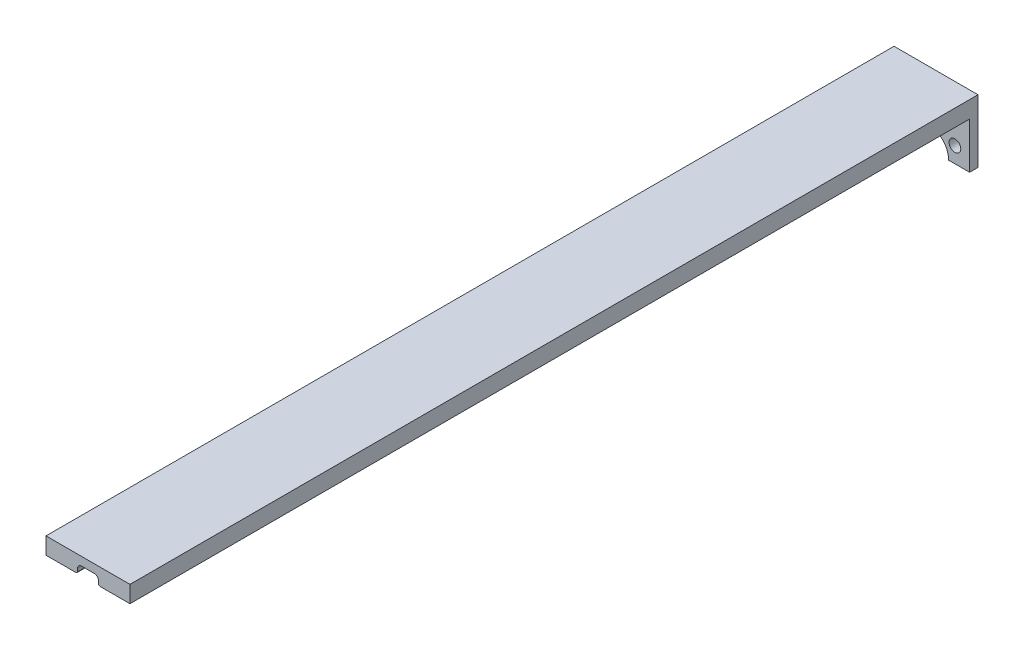
ISO-10303-21;
HEADER;
FILE_DESCRIPTION(('STEP AP214'),'2;1');
FILE_NAME('part.step','',(''),(''),'','','');
FILE_SCHEMA(('AUTOMOTIVE_DESIGN { 1 0 10303 214 1 1 1 1 }'));
ENDSEC;
DATA;
#1=APPLICATION_CONTEXT('core data for automotive mechanical design processes');
#2=APPLICATION_PROTOCOL_DEFINITION('international standard','automotive_design',2000,#1);
#3=PRODUCT_CONTEXT('',#1,'mechanical');
#4=PRODUCT('Part','Part','',(#3));
#5=PRODUCT_RELATED_PRODUCT_CATEGORY('part','',(#4));
#6=PRODUCT_DEFINITION_FORMATION('','',#4);
#7=PRODUCT_DEFINITION_CONTEXT('part definition',#1,'design');
#8=PRODUCT_DEFINITION('design','',#6,#7);
#9=PRODUCT_DEFINITION_SHAPE('','',#8);
#10=(LENGTH_UNIT() NAMED_UNIT(*) SI_UNIT(.MILLI.,.METRE.));
#11=(NAMED_UNIT(*) PLANE_ANGLE_UNIT() SI_UNIT($,.RADIAN.));
#12=(NAMED_UNIT(*) SI_UNIT($,.STERADIAN.) SOLID_ANGLE_UNIT());
#13=UNCERTAINTY_MEASURE_WITH_UNIT(LENGTH_MEASURE(1.E-05),#10,'distance_accuracy_value','');
#14=(GEOMETRIC_REPRESENTATION_CONTEXT(3) GLOBAL_UNCERTAINTY_ASSIGNED_CONTEXT((#13)) GLOBAL_UNIT_ASSIGNED_CONTEXT((#10,
#11,#12)) REPRESENTATION_CONTEXT('',''));
#15=CARTESIAN_POINT('',(0.,0.,0.));
#16=DIRECTION('',(0.,0.,1.));
#17=DIRECTION('',(1.,0.,0.));
#18=AXIS2_PLACEMENT_3D('',#15,#16,#17);
#19=CARTESIAN_POINT('',(0.,0.,2.54));
#20=DIRECTION('',(0.,0.,-1.));
#21=DIRECTION('',(-1.,0.,0.));
#22=AXIS2_PLACEMENT_3D('',#19,#20,#21);
#23=PLANE('',#22);
#24=CARTESIAN_POINT('',(8.24889197104678,4.7625,2.54));
#25=DIRECTION('',(0.,0.,1.));
#26=DIRECTION('',(1.,0.,0.));
#27=AXIS2_PLACEMENT_3D('',#24,#25,#26);
#28=CIRCLE('',#27,1.778);
#29=CARTESIAN_POINT('',(10.0268919710468,4.7625,2.54));
#30=VERTEX_POINT('',#29);
#31=EDGE_CURVE('E287',#30,#30,#28,.T.);
#32=ORIENTED_EDGE('',*,*,#31,.F.);
#33=EDGE_LOOP('',(#32));
#34=FACE_BOUND('',#33,.T.);
#35=CARTESIAN_POINT('',(-8.24889197104678,4.7625,2.54));
#36=DIRECTION('',(0.,0.,1.));
#37=DIRECTION('',(1.,0.,0.));
#38=AXIS2_PLACEMENT_3D('',#35,#36,#37);
#39=CIRCLE('',#38,1.778);
#40=CARTESIAN_POINT('',(-6.47089197104678,4.7625,2.54));
#41=VERTEX_POINT('',#40);
#42=EDGE_CURVE('E295',#41,#41,#39,.T.);
#43=ORIENTED_EDGE('',*,*,#42,.F.);
#44=EDGE_LOOP('',(#43));
#45=FACE_BOUND('',#44,.T.);
#46=DIRECTION('',(1.,0.,0.));
#47=VECTOR('',#46,1.);
#48=CARTESIAN_POINT('',(12.7,13.97,2.54));
#49=LINE('',#48,#47);
#50=CARTESIAN_POINT('',(3.683,13.97,2.54));
#51=VERTEX_POINT('',#50);
#52=CARTESIAN_POINT('',(12.7,13.97,2.54));
#53=VERTEX_POINT('',#52);
#54=EDGE_CURVE('E61',#51,#53,#49,.T.);
#55=ORIENTED_EDGE('',*,*,#54,.F.);
#56=CARTESIAN_POINT('',(3.683,14.478,2.54));
#57=DIRECTION('',(0.,0.,1.));
#58=DIRECTION('',(1.,0.,0.));
#59=AXIS2_PLACEMENT_3D('',#56,#57,#58);
#60=CIRCLE('',#59,0.507999999999998);
#61=CARTESIAN_POINT('',(3.175,14.478,2.54));
#62=VERTEX_POINT('',#61);
#63=EDGE_CURVE('E65',#62,#51,#60,.T.);
#64=ORIENTED_EDGE('',*,*,#63,.F.);
#65=DIRECTION('',(0.,-1.,0.));
#66=VECTOR('',#65,1.);
#67=CARTESIAN_POINT('',(3.175,14.478,2.54));
#68=LINE('',#67,#66);
#69=CARTESIAN_POINT('',(3.175,15.24,2.54));
#70=VERTEX_POINT('',#69);
#71=EDGE_CURVE('E244',#70,#62,#68,.T.);
#72=ORIENTED_EDGE('',*,*,#71,.F.);
#73=CARTESIAN_POINT('',(1.905,15.24,2.54));
#74=DIRECTION('',(0.,0.,-1.));
#75=DIRECTION('',(1.,0.,0.));
#76=AXIS2_PLACEMENT_3D('',#73,#74,#75);
#77=CIRCLE('',#76,1.27);
#78=CARTESIAN_POINT('',(1.905,16.51,2.54));
#79=VERTEX_POINT('',#78);
#80=EDGE_CURVE('E240',#79,#70,#77,.T.);
#81=ORIENTED_EDGE('',*,*,#80,.F.);
#82=DIRECTION('',(1.,0.,0.));
#83=VECTOR('',#82,1.);
#84=CARTESIAN_POINT('',(-1.905,16.51,2.54));
#85=LINE('',#84,#83);
#86=CARTESIAN_POINT('',(-1.905,16.51,2.54));
#87=VERTEX_POINT('',#86);
#88=EDGE_CURVE('E236',#87,#79,#85,.T.);
#89=ORIENTED_EDGE('',*,*,#88,.F.);
#90=CARTESIAN_POINT('',(-1.905,15.24,2.54));
#91=DIRECTION('',(0.,0.,-1.));
#92=DIRECTION('',(-1.,0.,0.));
#93=AXIS2_PLACEMENT_3D('',#90,#91,#92);
#94=CIRCLE('',#93,1.27);
#95=CARTESIAN_POINT('',(-3.175,15.24,2.54));
#96=VERTEX_POINT('',#95);
#97=EDGE_CURVE('E232',#96,#87,#94,.T.);
#98=ORIENTED_EDGE('',*,*,#97,.F.);
#99=DIRECTION('',(0.,1.,0.));
#100=VECTOR('',#99,1.);
#101=CARTESIAN_POINT('',(-3.175,14.478,2.54));
#102=LINE('',#101,#100);
#103=CARTESIAN_POINT('',(-3.175,14.478,2.54));
#104=VERTEX_POINT('',#103);
#105=EDGE_CURVE('E228',#104,#96,#102,.T.);
#106=ORIENTED_EDGE('',*,*,#105,.F.);
#107=CARTESIAN_POINT('',(-3.683,14.478,2.54));
#108=DIRECTION('',(0.,0.,1.));
#109=DIRECTION('',(1.,0.,0.));
#110=AXIS2_PLACEMENT_3D('',#107,#108,#109);
#111=CIRCLE('',#110,0.507999999999998);
#112=CARTESIAN_POINT('',(-3.683,13.97,2.54));
#113=VERTEX_POINT('',#112);
#114=EDGE_CURVE('E224',#113,#104,#111,.T.);
#115=ORIENTED_EDGE('',*,*,#114,.F.);
#116=DIRECTION('',(1.,0.,0.));
#117=VECTOR('',#116,1.);
#118=CARTESIAN_POINT('',(-12.7,13.97,2.54));
#119=LINE('',#118,#117);
#120=CARTESIAN_POINT('',(-12.7,13.97,2.54));
#121=VERTEX_POINT('',#120);
#122=EDGE_CURVE('E220',#121,#113,#119,.T.);
#123=ORIENTED_EDGE('',*,*,#122,.F.);
#124=DIRECTION('',(0.,-1.,0.));
#125=VECTOR('',#124,1.);
#126=CARTESIAN_POINT('',(-12.7,19.05,2.54));
#127=LINE('',#126,#125);
#128=CARTESIAN_POINT('',(-12.7,0.,2.54));
#129=VERTEX_POINT('',#128);
#130=EDGE_CURVE('E303',#121,#129,#127,.T.);
#131=ORIENTED_EDGE('',*,*,#130,.T.);
#132=DIRECTION('',(1.,0.,0.));
#133=VECTOR('',#132,1.);
#134=CARTESIAN_POINT('',(-12.7,0.,2.54));
#135=LINE('',#134,#133);
#136=CARTESIAN_POINT('',(-6.35,0.,2.54));
#137=VERTEX_POINT('',#136);
#138=EDGE_CURVE('E306',#129,#137,#135,.T.);
#139=ORIENTED_EDGE('',*,*,#138,.T.);
#140=CARTESIAN_POINT('',(0.,0.,2.54));
#141=DIRECTION('',(0.,0.,-1.));
#142=DIRECTION('',(-1.,0.,0.));
#143=AXIS2_PLACEMENT_3D('',#140,#141,#142);
#144=CIRCLE('',#143,6.35);
#145=CARTESIAN_POINT('',(6.35,0.,2.54));
#146=VERTEX_POINT('',#145);
#147=EDGE_CURVE('E309',#137,#146,#144,.T.);
#148=ORIENTED_EDGE('',*,*,#147,.T.);
#149=DIRECTION('',(1.,0.,0.));
#150=VECTOR('',#149,1.);
#151=CARTESIAN_POINT('',(6.35,0.,2.54));
#152=LINE('',#151,#150);
#153=CARTESIAN_POINT('',(12.7,0.,2.54));
#154=VERTEX_POINT('',#153);
#155=EDGE_CURVE('E312',#146,#154,#152,.T.);
#156=ORIENTED_EDGE('',*,*,#155,.T.);
#157=DIRECTION('',(0.,1.,0.));
#158=VECTOR('',#157,1.);
#159=CARTESIAN_POINT('',(12.7,0.,2.54));
#160=LINE('',#159,#158);
#161=EDGE_CURVE('E170',#154,#53,#160,.T.);
#162=ORIENTED_EDGE('',*,*,#161,.T.);
#163=EDGE_LOOP('',(#55,#64,#72,#81,#89,#98,#106,#115,#123,#131,#139,#148,#156,#162));
#164=FACE_BOUND('',#163,.T.);
#165=ADVANCED_FACE('F45',(#34,#45,#164),#23,.F.);
#166=CARTESIAN_POINT('',(0.,0.,0.));
#167=DIRECTION('',(0.,0.,-1.));
#168=DIRECTION('',(-1.,0.,0.));
#169=AXIS2_PLACEMENT_3D('',#166,#167,#168);
#170=PLANE('',#169);
#171=CARTESIAN_POINT('',(-8.24889197104678,4.7625,0.));
#172=DIRECTION('',(0.,0.,1.));
#173=DIRECTION('',(1.,0.,0.));
#174=AXIS2_PLACEMENT_3D('',#171,#172,#173);
#175=CIRCLE('',#174,1.778);
#176=CARTESIAN_POINT('',(-6.47089197104678,4.7625,0.));
#177=VERTEX_POINT('',#176);
#178=EDGE_CURVE('E291',#177,#177,#175,.T.);
#179=ORIENTED_EDGE('',*,*,#178,.T.);
#180=EDGE_LOOP('',(#179));
#181=FACE_BOUND('',#180,.T.);
#182=DIRECTION('',(0.,-1.,0.));
#183=VECTOR('',#182,1.);
#184=CARTESIAN_POINT('',(-12.7,19.05,0.));
#185=LINE('',#184,#183);
#186=CARTESIAN_POINT('',(-12.7,19.05,0.));
#187=VERTEX_POINT('',#186);
#188=CARTESIAN_POINT('',(-12.7,0.,0.));
#189=VERTEX_POINT('',#188);
#190=EDGE_CURVE('E299',#187,#189,#185,.T.);
#191=ORIENTED_EDGE('',*,*,#190,.F.);
#192=DIRECTION('',(-1.,0.,0.));
#193=VECTOR('',#192,1.);
#194=CARTESIAN_POINT('',(-12.7,19.05,0.));
#195=LINE('',#194,#193);
#196=CARTESIAN_POINT('',(12.7,19.05,0.));
#197=VERTEX_POINT('',#196);
#198=EDGE_CURVE('E164',#197,#187,#195,.T.);
#199=ORIENTED_EDGE('',*,*,#198,.F.);
#200=DIRECTION('',(0.,1.,0.));
#201=VECTOR('',#200,1.);
#202=CARTESIAN_POINT('',(12.7,0.,0.));
#203=LINE('',#202,#201);
#204=CARTESIAN_POINT('',(12.7,0.,0.));
#205=VERTEX_POINT('',#204);
#206=EDGE_CURVE('E328',#205,#197,#203,.T.);
#207=ORIENTED_EDGE('',*,*,#206,.F.);
#208=DIRECTION('',(1.,0.,0.));
#209=VECTOR('',#208,1.);
#210=CARTESIAN_POINT('',(6.35,0.,0.));
#211=LINE('',#210,#209);
#212=CARTESIAN_POINT('',(6.35,0.,0.));
#213=VERTEX_POINT('',#212);
#214=EDGE_CURVE('E325',#213,#205,#211,.T.);
#215=ORIENTED_EDGE('',*,*,#214,.F.);
#216=CARTESIAN_POINT('',(0.,0.,0.));
#217=DIRECTION('',(0.,0.,-1.));
#218=DIRECTION('',(-1.,0.,0.));
#219=AXIS2_PLACEMENT_3D('',#216,#217,#218);
#220=CIRCLE('',#219,6.35);
#221=CARTESIAN_POINT('',(-6.35,0.,0.));
#222=VERTEX_POINT('',#221);
#223=EDGE_CURVE('E322',#222,#213,#220,.T.);
#224=ORIENTED_EDGE('',*,*,#223,.F.);
#225=DIRECTION('',(1.,0.,0.));
#226=VECTOR('',#225,1.);
#227=CARTESIAN_POINT('',(-12.7,0.,0.));
#228=LINE('',#227,#226);
#229=EDGE_CURVE('E319',#189,#222,#228,.T.);
#230=ORIENTED_EDGE('',*,*,#229,.F.);
#231=EDGE_LOOP('',(#191,#199,#207,#215,#224,#230));
#232=FACE_BOUND('',#231,.T.);
#233=CARTESIAN_POINT('',(8.24889197104678,4.7625,0.));
#234=DIRECTION('',(0.,0.,1.));
#235=DIRECTION('',(1.,0.,0.));
#236=AXIS2_PLACEMENT_3D('',#233,#234,#235);
#237=CIRCLE('',#236,1.778);
#238=CARTESIAN_POINT('',(10.0268919710468,4.7625,0.));
#239=VERTEX_POINT('',#238);
#240=EDGE_CURVE('E286',#239,#239,#237,.T.);
#241=ORIENTED_EDGE('',*,*,#240,.T.);
#242=EDGE_LOOP('',(#241));
#243=FACE_BOUND('',#242,.T.);
#244=ADVANCED_FACE('F354',(#181,#232,#243),#170,.T.);
#245=CARTESIAN_POINT('',(-12.7,19.05,2.54));
#246=DIRECTION('',(1.,0.,0.));
#247=DIRECTION('',(0.,0.,-1.));
#248=AXIS2_PLACEMENT_3D('',#245,#246,#247);
#249=PLANE('',#248);
#250=ORIENTED_EDGE('',*,*,#190,.T.);
#251=DIRECTION('',(0.,0.,-1.));
#252=VECTOR('',#251,1.);
#253=CARTESIAN_POINT('',(-12.7,0.,2.54));
#254=LINE('',#253,#252);
#255=EDGE_CURVE('E11',#129,#189,#254,.T.);
#256=ORIENTED_EDGE('',*,*,#255,.F.);
#257=ORIENTED_EDGE('',*,*,#130,.F.);
#258=DIRECTION('',(0.,0.,-1.));
#259=VECTOR('',#258,1.);
#260=CARTESIAN_POINT('',(-12.7,13.97,256.54));
#261=LINE('',#260,#259);
#262=CARTESIAN_POINT('',(-12.7,13.97,256.54));
#263=VERTEX_POINT('',#262);
#264=EDGE_CURVE('E176',#263,#121,#261,.T.);
#265=ORIENTED_EDGE('',*,*,#264,.F.);
#266=DIRECTION('',(0.,-1.,0.));
#267=VECTOR('',#266,1.);
#268=CARTESIAN_POINT('',(-12.7,19.05,256.54));
#269=LINE('',#268,#267);
#270=CARTESIAN_POINT('',(-12.7,19.05,256.54));
#271=VERTEX_POINT('',#270);
#272=EDGE_CURVE('E173',#271,#263,#269,.T.);
#273=ORIENTED_EDGE('',*,*,#272,.F.);
#274=DIRECTION('',(0.,0.,-1.));
#275=VECTOR('',#274,1.);
#276=CARTESIAN_POINT('',(-12.7,19.05,2.54));
#277=LINE('',#276,#275);
#278=EDGE_CURVE('E157',#271,#187,#277,.T.);
#279=ORIENTED_EDGE('',*,*,#278,.T.);
#280=EDGE_LOOP('',(#250,#256,#257,#265,#273,#279));
#281=FACE_BOUND('',#280,.T.);
#282=ADVANCED_FACE('F47',(#281),#249,.F.);
#283=CARTESIAN_POINT('',(-12.7,0.,2.54));
#284=DIRECTION('',(0.,1.,0.));
#285=DIRECTION('',(0.,0.,1.));
#286=AXIS2_PLACEMENT_3D('',#283,#284,#285);
#287=PLANE('',#286);
#288=ORIENTED_EDGE('',*,*,#229,.T.);
#289=DIRECTION('',(0.,0.,-1.));
#290=VECTOR('',#289,1.);
#291=CARTESIAN_POINT('',(-6.35,0.,2.54));
#292=LINE('',#291,#290);
#293=EDGE_CURVE('E54',#137,#222,#292,.T.);
#294=ORIENTED_EDGE('',*,*,#293,.F.);
#295=ORIENTED_EDGE('',*,*,#138,.F.);
#296=ORIENTED_EDGE('',*,*,#255,.T.);
#297=EDGE_LOOP('',(#288,#294,#295,#296));
#298=FACE_BOUND('',#297,.T.);
#299=ADVANCED_FACE('F400',(#298),#287,.F.);
#300=CARTESIAN_POINT('',(0.,0.,2.54));
#301=DIRECTION('',(0.,0.,-1.));
#302=DIRECTION('',(-1.,0.,0.));
#303=AXIS2_PLACEMENT_3D('',#300,#301,#302);
#304=CYLINDRICAL_SURFACE('',#303,6.35);
#305=ORIENTED_EDGE('',*,*,#223,.T.);
#306=DIRECTION('',(0.,0.,-1.));
#307=VECTOR('',#306,1.);
#308=CARTESIAN_POINT('',(6.35,0.,2.54));
#309=LINE('',#308,#307);
#310=EDGE_CURVE('E339',#146,#213,#309,.T.);
#311=ORIENTED_EDGE('',*,*,#310,.F.);
#312=ORIENTED_EDGE('',*,*,#147,.F.);
#313=ORIENTED_EDGE('',*,*,#293,.T.);
#314=EDGE_LOOP('',(#305,#311,#312,#313));
#315=FACE_BOUND('',#314,.T.);
#316=ADVANCED_FACE('F348',(#315),#304,.F.);
#317=CARTESIAN_POINT('',(6.35,0.,2.54));
#318=DIRECTION('',(0.,1.,0.));
#319=DIRECTION('',(0.,0.,1.));
#320=AXIS2_PLACEMENT_3D('',#317,#318,#319);
#321=PLANE('',#320);
#322=ORIENTED_EDGE('',*,*,#214,.T.);
#323=DIRECTION('',(0.,0.,-1.));
#324=VECTOR('',#323,1.);
#325=CARTESIAN_POINT('',(12.7,0.,2.54));
#326=LINE('',#325,#324);
#327=EDGE_CURVE('E335',#154,#205,#326,.T.);
#328=ORIENTED_EDGE('',*,*,#327,.F.);
#329=ORIENTED_EDGE('',*,*,#155,.F.);
#330=ORIENTED_EDGE('',*,*,#310,.T.);
#331=EDGE_LOOP('',(#322,#328,#329,#330));
#332=FACE_BOUND('',#331,.T.);
#333=ADVANCED_FACE('F359',(#332),#321,.F.);
#334=CARTESIAN_POINT('',(12.7,0.,2.54));
#335=DIRECTION('',(-1.,0.,0.));
#336=DIRECTION('',(0.,0.,1.));
#337=AXIS2_PLACEMENT_3D('',#334,#335,#336);
#338=PLANE('',#337);
#339=ORIENTED_EDGE('',*,*,#206,.T.);
#340=DIRECTION('',(0.,0.,-1.));
#341=VECTOR('',#340,1.);
#342=CARTESIAN_POINT('',(12.7,19.05,2.54));
#343=LINE('',#342,#341);
#344=CARTESIAN_POINT('',(12.7,19.05,256.54));
#345=VERTEX_POINT('',#344);
#346=EDGE_CURVE('E169',#345,#197,#343,.T.);
#347=ORIENTED_EDGE('',*,*,#346,.F.);
#348=DIRECTION('',(0.,1.,0.));
#349=VECTOR('',#348,1.);
#350=CARTESIAN_POINT('',(12.7,19.05,256.54));
#351=LINE('',#350,#349);
#352=CARTESIAN_POINT('',(12.7,13.97,256.54));
#353=VERTEX_POINT('',#352);
#354=EDGE_CURVE('E185',#353,#345,#351,.T.);
#355=ORIENTED_EDGE('',*,*,#354,.F.);
#356=DIRECTION('',(0.,0.,-1.));
#357=VECTOR('',#356,1.);
#358=CARTESIAN_POINT('',(12.7,13.97,256.54));
#359=LINE('',#358,#357);
#360=EDGE_CURVE('E219',#353,#53,#359,.T.);
#361=ORIENTED_EDGE('',*,*,#360,.T.);
#362=ORIENTED_EDGE('',*,*,#161,.F.);
#363=ORIENTED_EDGE('',*,*,#327,.T.);
#364=EDGE_LOOP('',(#339,#347,#355,#361,#362,#363));
#365=FACE_BOUND('',#364,.T.);
#366=ADVANCED_FACE('F363',(#365),#338,.F.);
#367=CARTESIAN_POINT('',(-12.7,19.05,2.54));
#368=DIRECTION('',(0.,-1.,0.));
#369=DIRECTION('',(0.,0.,-1.));
#370=AXIS2_PLACEMENT_3D('',#367,#368,#369);
#371=PLANE('',#370);
#372=ORIENTED_EDGE('',*,*,#198,.T.);
#373=ORIENTED_EDGE('',*,*,#278,.F.);
#374=DIRECTION('',(-1.,0.,0.));
#375=VECTOR('',#374,1.);
#376=CARTESIAN_POINT('',(-12.7,19.05,256.54));
#377=LINE('',#376,#375);
#378=EDGE_CURVE('E162',#345,#271,#377,.T.);
#379=ORIENTED_EDGE('',*,*,#378,.F.);
#380=ORIENTED_EDGE('',*,*,#346,.T.);
#381=EDGE_LOOP('',(#372,#373,#379,#380));
#382=FACE_BOUND('',#381,.T.);
#383=ADVANCED_FACE('F159',(#382),#371,.F.);
#384=CARTESIAN_POINT('',(-8.24889197104678,4.7625,2.54));
#385=DIRECTION('',(0.,0.,-1.));
#386=DIRECTION('',(-1.,0.,0.));
#387=AXIS2_PLACEMENT_3D('',#384,#385,#386);
#388=CYLINDRICAL_SURFACE('',#387,1.778);
#389=ORIENTED_EDGE('',*,*,#42,.T.);
#390=EDGE_LOOP('',(#389));
#391=FACE_BOUND('',#390,.T.);
#392=ORIENTED_EDGE('',*,*,#178,.F.);
#393=EDGE_LOOP('',(#392));
#394=FACE_BOUND('',#393,.T.);
#395=ADVANCED_FACE('F419',(#391,#394),#388,.F.);
#396=CARTESIAN_POINT('',(8.24889197104678,4.7625,2.54));
#397=DIRECTION('',(0.,0.,-1.));
#398=DIRECTION('',(-1.,0.,0.));
#399=AXIS2_PLACEMENT_3D('',#396,#397,#398);
#400=CYLINDRICAL_SURFACE('',#399,1.778);
#401=ORIENTED_EDGE('',*,*,#31,.T.);
#402=EDGE_LOOP('',(#401));
#403=FACE_BOUND('',#402,.T.);
#404=ORIENTED_EDGE('',*,*,#240,.F.);
#405=EDGE_LOOP('',(#404));
#406=FACE_BOUND('',#405,.T.);
#407=ADVANCED_FACE('F438',(#403,#406),#400,.F.);
#408=CARTESIAN_POINT('',(-12.7,13.97,256.54));
#409=DIRECTION('',(0.,1.,0.));
#410=DIRECTION('',(0.,0.,1.));
#411=AXIS2_PLACEMENT_3D('',#408,#409,#410);
#412=PLANE('',#411);
#413=ORIENTED_EDGE('',*,*,#122,.T.);
#414=DIRECTION('',(0.,0.,-1.));
#415=VECTOR('',#414,1.);
#416=CARTESIAN_POINT('',(-3.683,13.97,256.54));
#417=LINE('',#416,#415);
#418=CARTESIAN_POINT('',(-3.683,13.97,256.54));
#419=VERTEX_POINT('',#418);
#420=EDGE_CURVE('E280',#419,#113,#417,.T.);
#421=ORIENTED_EDGE('',*,*,#420,.F.);
#422=DIRECTION('',(1.,0.,0.));
#423=VECTOR('',#422,1.);
#424=CARTESIAN_POINT('',(-12.7,13.97,256.54));
#425=LINE('',#424,#423);
#426=EDGE_CURVE('E180',#263,#419,#425,.T.);
#427=ORIENTED_EDGE('',*,*,#426,.F.);
#428=ORIENTED_EDGE('',*,*,#264,.T.);
#429=EDGE_LOOP('',(#413,#421,#427,#428));
#430=FACE_BOUND('',#429,.T.);
#431=ADVANCED_FACE('F398',(#430),#412,.F.);
#432=CARTESIAN_POINT('',(-3.683,14.478,256.54));
#433=DIRECTION('',(0.,0.,-1.));
#434=DIRECTION('',(-1.,0.,0.));
#435=AXIS2_PLACEMENT_3D('',#432,#433,#434);
#436=CYLINDRICAL_SURFACE('',#435,0.507999999999998);
#437=ORIENTED_EDGE('',*,*,#114,.T.);
#438=DIRECTION('',(0.,0.,-1.));
#439=VECTOR('',#438,1.);
#440=CARTESIAN_POINT('',(-3.175,14.478,256.54));
#441=LINE('',#440,#439);
#442=CARTESIAN_POINT('',(-3.175,14.478,256.54));
#443=VERTEX_POINT('',#442);
#444=EDGE_CURVE('E276',#443,#104,#441,.T.);
#445=ORIENTED_EDGE('',*,*,#444,.F.);
#446=CARTESIAN_POINT('',(-3.683,14.478,256.54));
#447=DIRECTION('',(0.,0.,1.));
#448=DIRECTION('',(1.,0.,0.));
#449=AXIS2_PLACEMENT_3D('',#446,#447,#448);
#450=CIRCLE('',#449,0.507999999999998);
#451=EDGE_CURVE('E193',#419,#443,#450,.T.);
#452=ORIENTED_EDGE('',*,*,#451,.F.);
#453=ORIENTED_EDGE('',*,*,#420,.T.);
#454=EDGE_LOOP('',(#437,#445,#452,#453));
#455=FACE_BOUND('',#454,.T.);
#456=ADVANCED_FACE('F394',(#455),#436,.T.);
#457=CARTESIAN_POINT('',(-3.175,14.478,256.54));
#458=DIRECTION('',(-1.,0.,0.));
#459=DIRECTION('',(0.,0.,1.));
#460=AXIS2_PLACEMENT_3D('',#457,#458,#459);
#461=PLANE('',#460);
#462=ORIENTED_EDGE('',*,*,#105,.T.);
#463=DIRECTION('',(0.,0.,-1.));
#464=VECTOR('',#463,1.);
#465=CARTESIAN_POINT('',(-3.175,15.24,256.54));
#466=LINE('',#465,#464);
#467=CARTESIAN_POINT('',(-3.175,15.24,256.54));
#468=VERTEX_POINT('',#467);
#469=EDGE_CURVE('E272',#468,#96,#466,.T.);
#470=ORIENTED_EDGE('',*,*,#469,.F.);
#471=DIRECTION('',(0.,1.,0.));
#472=VECTOR('',#471,1.);
#473=CARTESIAN_POINT('',(-3.175,14.478,256.54));
#474=LINE('',#473,#472);
#475=EDGE_CURVE('E196',#443,#468,#474,.T.);
#476=ORIENTED_EDGE('',*,*,#475,.F.);
#477=ORIENTED_EDGE('',*,*,#444,.T.);
#478=EDGE_LOOP('',(#462,#470,#476,#477));
#479=FACE_BOUND('',#478,.T.);
#480=ADVANCED_FACE('F391',(#479),#461,.F.);
#481=CARTESIAN_POINT('',(-1.905,15.24,256.54));
#482=DIRECTION('',(0.,0.,-1.));
#483=DIRECTION('',(-1.,0.,0.));
#484=AXIS2_PLACEMENT_3D('',#481,#482,#483);
#485=CYLINDRICAL_SURFACE('',#484,1.27);
#486=ORIENTED_EDGE('',*,*,#97,.T.);
#487=DIRECTION('',(0.,0.,-1.));
#488=VECTOR('',#487,1.);
#489=CARTESIAN_POINT('',(-1.905,16.51,256.54));
#490=LINE('',#489,#488);
#491=CARTESIAN_POINT('',(-1.905,16.51,256.54));
#492=VERTEX_POINT('',#491);
#493=EDGE_CURVE('E268',#492,#87,#490,.T.);
#494=ORIENTED_EDGE('',*,*,#493,.F.);
#495=CARTESIAN_POINT('',(-1.905,15.24,256.54));
#496=DIRECTION('',(0.,0.,-1.));
#497=DIRECTION('',(-1.,0.,0.));
#498=AXIS2_PLACEMENT_3D('',#495,#496,#497);
#499=CIRCLE('',#498,1.27);
#500=EDGE_CURVE('E199',#468,#492,#499,.T.);
#501=ORIENTED_EDGE('',*,*,#500,.F.);
#502=ORIENTED_EDGE('',*,*,#469,.T.);
#503=EDGE_LOOP('',(#486,#494,#501,#502));
#504=FACE_BOUND('',#503,.T.);
#505=ADVANCED_FACE('F386',(#504),#485,.F.);
#506=CARTESIAN_POINT('',(-1.905,16.51,256.54));
#507=DIRECTION('',(0.,1.,0.));
#508=DIRECTION('',(0.,0.,1.));
#509=AXIS2_PLACEMENT_3D('',#506,#507,#508);
#510=PLANE('',#509);
#511=ORIENTED_EDGE('',*,*,#88,.T.);
#512=DIRECTION('',(0.,0.,-1.));
#513=VECTOR('',#512,1.);
#514=CARTESIAN_POINT('',(1.905,16.51,256.54));
#515=LINE('',#514,#513);
#516=CARTESIAN_POINT('',(1.905,16.51,256.54));
#517=VERTEX_POINT('',#516);
#518=EDGE_CURVE('E264',#517,#79,#515,.T.);
#519=ORIENTED_EDGE('',*,*,#518,.F.);
#520=DIRECTION('',(1.,0.,0.));
#521=VECTOR('',#520,1.);
#522=CARTESIAN_POINT('',(-1.905,16.51,256.54));
#523=LINE('',#522,#521);
#524=EDGE_CURVE('E202',#492,#517,#523,.T.);
#525=ORIENTED_EDGE('',*,*,#524,.F.);
#526=ORIENTED_EDGE('',*,*,#493,.T.);
#527=EDGE_LOOP('',(#511,#519,#525,#526));
#528=FACE_BOUND('',#527,.T.);
#529=ADVANCED_FACE('F383',(#528),#510,.F.);
#530=CARTESIAN_POINT('',(1.905,15.24,256.54));
#531=DIRECTION('',(0.,0.,-1.));
#532=DIRECTION('',(-1.,0.,0.));
#533=AXIS2_PLACEMENT_3D('',#530,#531,#532);
#534=CYLINDRICAL_SURFACE('',#533,1.27);
#535=ORIENTED_EDGE('',*,*,#80,.T.);
#536=DIRECTION('',(0.,0.,-1.));
#537=VECTOR('',#536,1.);
#538=CARTESIAN_POINT('',(3.175,15.24,256.54));
#539=LINE('',#538,#537);
#540=CARTESIAN_POINT('',(3.175,15.24,256.54));
#541=VERTEX_POINT('',#540);
#542=EDGE_CURVE('E260',#541,#70,#539,.T.);
#543=ORIENTED_EDGE('',*,*,#542,.F.);
#544=CARTESIAN_POINT('',(1.905,15.24,256.54));
#545=DIRECTION('',(0.,0.,-1.));
#546=DIRECTION('',(1.,0.,0.));
#547=AXIS2_PLACEMENT_3D('',#544,#545,#546);
#548=CIRCLE('',#547,1.27);
#549=EDGE_CURVE('E205',#517,#541,#548,.T.);
#550=ORIENTED_EDGE('',*,*,#549,.F.);
#551=ORIENTED_EDGE('',*,*,#518,.T.);
#552=EDGE_LOOP('',(#535,#543,#550,#551));
#553=FACE_BOUND('',#552,.T.);
#554=ADVANCED_FACE('F378',(#553),#534,.F.);
#555=CARTESIAN_POINT('',(3.175,14.478,256.54));
#556=DIRECTION('',(1.,0.,0.));
#557=DIRECTION('',(0.,0.,-1.));
#558=AXIS2_PLACEMENT_3D('',#555,#556,#557);
#559=PLANE('',#558);
#560=ORIENTED_EDGE('',*,*,#71,.T.);
#561=DIRECTION('',(0.,0.,-1.));
#562=VECTOR('',#561,1.);
#563=CARTESIAN_POINT('',(3.175,14.478,256.54));
#564=LINE('',#563,#562);
#565=CARTESIAN_POINT('',(3.175,14.478,256.54));
#566=VERTEX_POINT('',#565);
#567=EDGE_CURVE('E256',#566,#62,#564,.T.);
#568=ORIENTED_EDGE('',*,*,#567,.F.);
#569=DIRECTION('',(0.,-1.,0.));
#570=VECTOR('',#569,1.);
#571=CARTESIAN_POINT('',(3.175,14.478,256.54));
#572=LINE('',#571,#570);
#573=EDGE_CURVE('E208',#541,#566,#572,.T.);
#574=ORIENTED_EDGE('',*,*,#573,.F.);
#575=ORIENTED_EDGE('',*,*,#542,.T.);
#576=EDGE_LOOP('',(#560,#568,#574,#575));
#577=FACE_BOUND('',#576,.T.);
#578=ADVANCED_FACE('F375',(#577),#559,.F.);
#579=CARTESIAN_POINT('',(3.683,14.478,256.54));
#580=DIRECTION('',(0.,0.,-1.));
#581=DIRECTION('',(-1.,0.,0.));
#582=AXIS2_PLACEMENT_3D('',#579,#580,#581);
#583=CYLINDRICAL_SURFACE('',#582,0.507999999999998);
#584=ORIENTED_EDGE('',*,*,#63,.T.);
#585=DIRECTION('',(0.,0.,-1.));
#586=VECTOR('',#585,1.);
#587=CARTESIAN_POINT('',(3.683,13.97,256.54));
#588=LINE('',#587,#586);
#589=CARTESIAN_POINT('',(3.683,13.97,256.54));
#590=VERTEX_POINT('',#589);
#591=EDGE_CURVE('E252',#590,#51,#588,.T.);
#592=ORIENTED_EDGE('',*,*,#591,.F.);
#593=CARTESIAN_POINT('',(3.683,14.478,256.54));
#594=DIRECTION('',(0.,0.,1.));
#595=DIRECTION('',(1.,0.,0.));
#596=AXIS2_PLACEMENT_3D('',#593,#594,#595);
#597=CIRCLE('',#596,0.507999999999998);
#598=EDGE_CURVE('E211',#566,#590,#597,.T.);
#599=ORIENTED_EDGE('',*,*,#598,.F.);
#600=ORIENTED_EDGE('',*,*,#567,.T.);
#601=EDGE_LOOP('',(#584,#592,#599,#600));
#602=FACE_BOUND('',#601,.T.);
#603=ADVANCED_FACE('F371',(#602),#583,.T.);
#604=CARTESIAN_POINT('',(12.7,13.97,256.54));
#605=DIRECTION('',(0.,1.,0.));
#606=DIRECTION('',(-1.,0.,0.));
#607=AXIS2_PLACEMENT_3D('',#604,#605,#606);
#608=PLANE('',#607);
#609=ORIENTED_EDGE('',*,*,#54,.T.);
#610=ORIENTED_EDGE('',*,*,#360,.F.);
#611=DIRECTION('',(1.,0.,0.));
#612=VECTOR('',#611,1.);
#613=CARTESIAN_POINT('',(12.7,13.97,256.54));
#614=LINE('',#613,#612);
#615=EDGE_CURVE('E214',#590,#353,#614,.T.);
#616=ORIENTED_EDGE('',*,*,#615,.F.);
#617=ORIENTED_EDGE('',*,*,#591,.T.);
#618=EDGE_LOOP('',(#609,#610,#616,#617));
#619=FACE_BOUND('',#618,.T.);
#620=ADVANCED_FACE('F366',(#619),#608,.F.);
#621=CARTESIAN_POINT('',(3.683,14.478,256.54));
#622=DIRECTION('',(0.,0.,1.));
#623=DIRECTION('',(1.,0.,0.));
#624=AXIS2_PLACEMENT_3D('',#621,#622,#623);
#625=PLANE('',#624);
#626=ORIENTED_EDGE('',*,*,#378,.T.);
#627=ORIENTED_EDGE('',*,*,#272,.T.);
#628=ORIENTED_EDGE('',*,*,#426,.T.);
#629=ORIENTED_EDGE('',*,*,#451,.T.);
#630=ORIENTED_EDGE('',*,*,#475,.T.);
#631=ORIENTED_EDGE('',*,*,#500,.T.);
#632=ORIENTED_EDGE('',*,*,#524,.T.);
#633=ORIENTED_EDGE('',*,*,#549,.T.);
#634=ORIENTED_EDGE('',*,*,#573,.T.);
#635=ORIENTED_EDGE('',*,*,#598,.T.);
#636=ORIENTED_EDGE('',*,*,#615,.T.);
#637=ORIENTED_EDGE('',*,*,#354,.T.);
#638=EDGE_LOOP('',(#626,#627,#628,#629,#630,#631,#632,#633,#634,#635,#636,#637));
#639=FACE_BOUND('',#638,.T.);
#640=ADVANCED_FACE('F183',(#639),#625,.T.);
#641=CLOSED_SHELL('',(#165,#244,#282,#299,#316,#333,#366,#383,#395,#407,#431,#456,#480,#505,
#529,#554,#578,#603,#620,#640));
#642=MANIFOLD_SOLID_BREP('B2',#641);
#643=ADVANCED_BREP_SHAPE_REPRESENTATION('',(#18,#642),#14);
#644=SHAPE_DEFINITION_REPRESENTATION(#9,#643);
ENDSEC;
END-ISO-10303-21;
